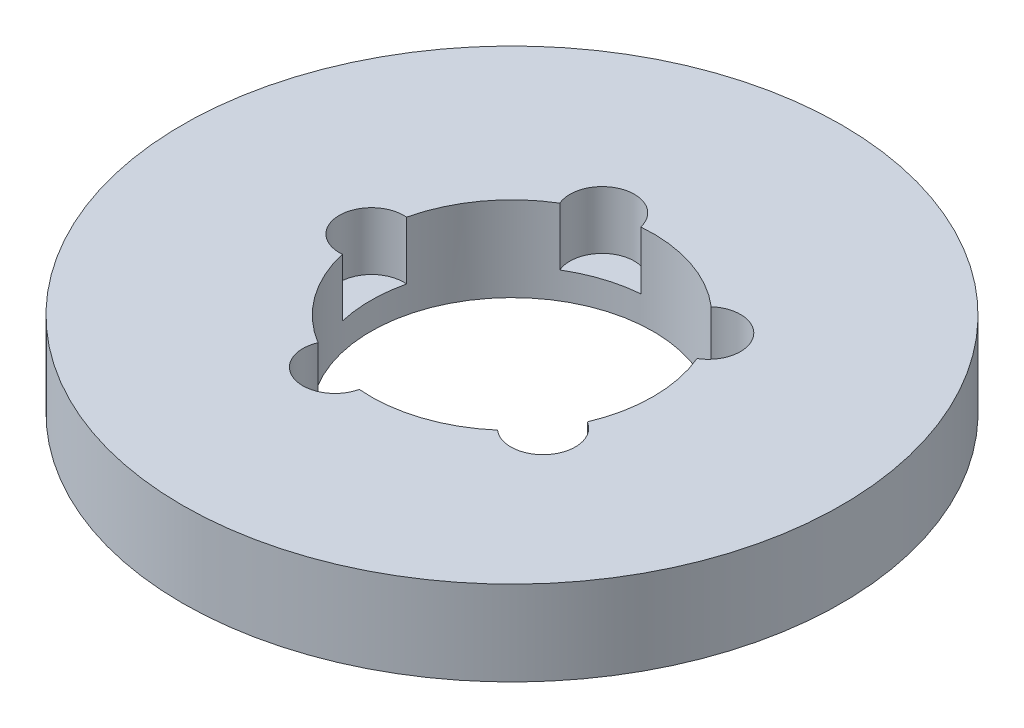
ISO-10303-21;
HEADER;
FILE_DESCRIPTION(('STEP AP214'),'2;1');
FILE_NAME('part.step','',(''),(''),'','','');
FILE_SCHEMA(('AUTOMOTIVE_DESIGN { 1 0 10303 214 1 1 1 1 }'));
ENDSEC;
DATA;
#1=APPLICATION_CONTEXT('core data for automotive mechanical design processes');
#2=APPLICATION_PROTOCOL_DEFINITION('international standard','automotive_design',2000,#1);
#3=PRODUCT_CONTEXT('',#1,'mechanical');
#4=PRODUCT('Part','Part','',(#3));
#5=PRODUCT_RELATED_PRODUCT_CATEGORY('part','',(#4));
#6=PRODUCT_DEFINITION_FORMATION('','',#4);
#7=PRODUCT_DEFINITION_CONTEXT('part definition',#1,'design');
#8=PRODUCT_DEFINITION('design','',#6,#7);
#9=PRODUCT_DEFINITION_SHAPE('','',#8);
#10=(LENGTH_UNIT() NAMED_UNIT(*) SI_UNIT(.MILLI.,.METRE.));
#11=(NAMED_UNIT(*) PLANE_ANGLE_UNIT() SI_UNIT($,.RADIAN.));
#12=(NAMED_UNIT(*) SI_UNIT($,.STERADIAN.) SOLID_ANGLE_UNIT());
#13=UNCERTAINTY_MEASURE_WITH_UNIT(LENGTH_MEASURE(1.E-05),#10,'distance_accuracy_value','');
#14=(GEOMETRIC_REPRESENTATION_CONTEXT(3) GLOBAL_UNCERTAINTY_ASSIGNED_CONTEXT((#13)) GLOBAL_UNIT_ASSIGNED_CONTEXT((#10,
#11,#12)) REPRESENTATION_CONTEXT('',''));
#15=CARTESIAN_POINT('',(0.,0.,0.));
#16=DIRECTION('',(0.,0.,1.));
#17=DIRECTION('',(1.,0.,0.));
#18=AXIS2_PLACEMENT_3D('',#15,#16,#17);
#19=CARTESIAN_POINT('',(0.,18.,0.));
#20=DIRECTION('',(0.,-1.,0.));
#21=DIRECTION('',(0.,0.,-1.));
#22=AXIS2_PLACEMENT_3D('',#19,#20,#21);
#23=CYLINDRICAL_SURFACE('',#22,70.);
#24=CARTESIAN_POINT('',(0.,18.,0.));
#25=DIRECTION('',(0.,1.,0.));
#26=DIRECTION('',(0.,0.,1.));
#27=AXIS2_PLACEMENT_3D('',#24,#25,#26);
#28=CIRCLE('',#27,70.);
#29=CARTESIAN_POINT('',(0.,18.,70.));
#30=VERTEX_POINT('',#29);
#31=EDGE_CURVE('E157',#30,#30,#28,.T.);
#32=ORIENTED_EDGE('',*,*,#31,.F.);
#33=EDGE_LOOP('',(#32));
#34=FACE_BOUND('',#33,.T.);
#35=CARTESIAN_POINT('',(0.,0.,0.));
#36=DIRECTION('',(0.,1.,0.));
#37=DIRECTION('',(0.,0.,1.));
#38=AXIS2_PLACEMENT_3D('',#35,#36,#37);
#39=CIRCLE('',#38,70.);
#40=CARTESIAN_POINT('',(0.,0.,70.));
#41=VERTEX_POINT('',#40);
#42=EDGE_CURVE('E150',#41,#41,#39,.T.);
#43=ORIENTED_EDGE('',*,*,#42,.T.);
#44=EDGE_LOOP('',(#43));
#45=FACE_BOUND('',#44,.T.);
#46=ADVANCED_FACE('F39',(#34,#45),#23,.T.);
#47=CARTESIAN_POINT('',(0.,18.,0.));
#48=DIRECTION('',(0.,1.,0.));
#49=DIRECTION('',(0.,0.,1.));
#50=AXIS2_PLACEMENT_3D('',#47,#48,#49);
#51=PLANE('',#50);
#52=CARTESIAN_POINT('',(-9.21993099503934,18.,-28.3760298373233));
#53=DIRECTION('',(0.,1.,0.));
#54=DIRECTION('',(-0.95105651629515,0.,0.309016994374958));
#55=AXIS2_PLACEMENT_3D('',#52,#53,#54);
#56=CIRCLE('',#55,6.85275653735865);
#57=CARTESIAN_POINT('',(-2.53707938907956,18.,-29.8925279655888));
#58=VERTEX_POINT('',#57);
#59=CARTESIAN_POINT('',(-15.5178467500702,18.,-25.6748209777855));
#60=VERTEX_POINT('',#59);
#61=EDGE_CURVE('E194',#58,#60,#56,.T.);
#62=ORIENTED_EDGE('',*,*,#61,.F.);
#63=CARTESIAN_POINT('',(0.,18.,0.));
#64=DIRECTION('',(0.,1.,0.));
#65=DIRECTION('',(0.,0.,1.));
#66=AXIS2_PLACEMENT_3D('',#63,#64,#65);
#67=CIRCLE('',#66,30.);
#68=CARTESIAN_POINT('',(19.6229274337567,18.,-22.6923052801939));
#69=VERTEX_POINT('',#68);
#70=EDGE_CURVE('E147',#69,#58,#67,.T.);
#71=ORIENTED_EDGE('',*,*,#70,.F.);
#72=CARTESIAN_POINT('',(24.1380927189406,18.,-17.5373509052472));
#73=DIRECTION('',(0.,1.,0.));
#74=DIRECTION('',(-0.58778525229248,0.,-0.809016994374942));
#75=AXIS2_PLACEMENT_3D('',#72,#73,#74);
#76=CIRCLE('',#75,6.85275653735865);
#77=CARTESIAN_POINT('',(27.6454828629044,18.,-11.6502050315375));
#78=VERTEX_POINT('',#77);
#79=EDGE_CURVE('E254',#78,#69,#76,.T.);
#80=ORIENTED_EDGE('',*,*,#79,.F.);
#81=CARTESIAN_POINT('',(27.6454828629045,18.,11.6502050315371));
#82=VERTEX_POINT('',#81);
#83=EDGE_CURVE('E144',#82,#78,#67,.T.);
#84=ORIENTED_EDGE('',*,*,#83,.F.);
#85=CARTESIAN_POINT('',(24.1380927189409,18.,17.5373509052469));
#86=DIRECTION('',(0.,1.,0.));
#87=DIRECTION('',(0.587785252292469,0.,-0.809016994374951));
#88=AXIS2_PLACEMENT_3D('',#85,#86,#87);
#89=CIRCLE('',#88,6.85275653735865);
#90=CARTESIAN_POINT('',(19.6229274337571,18.,22.6923052801936));
#91=VERTEX_POINT('',#90);
#92=EDGE_CURVE('E141',#91,#82,#89,.T.);
#93=ORIENTED_EDGE('',*,*,#92,.F.);
#94=CARTESIAN_POINT('',(-2.53707938907914,18.,29.8925279655888));
#95=VERTEX_POINT('',#94);
#96=EDGE_CURVE('E134',#95,#91,#67,.T.);
#97=ORIENTED_EDGE('',*,*,#96,.F.);
#98=CARTESIAN_POINT('',(-9.21993099503894,18.,28.3760298373235));
#99=DIRECTION('',(0.,1.,0.));
#100=DIRECTION('',(0.951056516295155,0.,0.309016994374945));
#101=AXIS2_PLACEMENT_3D('',#98,#99,#100);
#102=CIRCLE('',#101,6.85275653735865);
#103=CARTESIAN_POINT('',(-15.5178467500699,18.,25.6748209777857));
#104=VERTEX_POINT('',#103);
#105=EDGE_CURVE('E111',#104,#95,#102,.T.);
#106=ORIENTED_EDGE('',*,*,#105,.F.);
#107=CARTESIAN_POINT('',(-29.2134841575122,18.,6.82439326085339));
#108=VERTEX_POINT('',#107);
#109=EDGE_CURVE('E145',#108,#104,#67,.T.);
#110=ORIENTED_EDGE('',*,*,#109,.F.);
#111=CARTESIAN_POINT('',(-29.8363234478035,18.,0.));
#112=DIRECTION('',(0.,1.,0.));
#113=DIRECTION('',(0.,0.,1.));
#114=AXIS2_PLACEMENT_3D('',#111,#112,#113);
#115=CIRCLE('',#114,6.85275653735865);
#116=CARTESIAN_POINT('',(-29.2134841575122,18.,-6.82439326085339));
#117=VERTEX_POINT('',#116);
#118=EDGE_CURVE('E153',#117,#108,#115,.T.);
#119=ORIENTED_EDGE('',*,*,#118,.F.);
#120=EDGE_CURVE('E146',#60,#117,#67,.T.);
#121=ORIENTED_EDGE('',*,*,#120,.F.);
#122=EDGE_LOOP('',(#62,#71,#80,#84,#93,#97,#106,#110,#119,#121));
#123=FACE_BOUND('',#122,.T.);
#124=ORIENTED_EDGE('',*,*,#31,.T.);
#125=EDGE_LOOP('',(#124));
#126=FACE_BOUND('',#125,.T.);
#127=ADVANCED_FACE('F139',(#123,#126),#51,.T.);
#128=CARTESIAN_POINT('',(0.,0.,0.));
#129=DIRECTION('',(0.,1.,0.));
#130=DIRECTION('',(0.,0.,1.));
#131=AXIS2_PLACEMENT_3D('',#128,#129,#130);
#132=PLANE('',#131);
#133=CARTESIAN_POINT('',(0.,0.,0.));
#134=DIRECTION('',(0.,1.,0.));
#135=DIRECTION('',(0.,0.,1.));
#136=AXIS2_PLACEMENT_3D('',#133,#134,#135);
#137=CIRCLE('',#136,30.);
#138=CARTESIAN_POINT('',(0.,0.,30.));
#139=VERTEX_POINT('',#138);
#140=EDGE_CURVE('E154',#139,#139,#137,.T.);
#141=ORIENTED_EDGE('',*,*,#140,.T.);
#142=EDGE_LOOP('',(#141));
#143=FACE_BOUND('',#142,.T.);
#144=ORIENTED_EDGE('',*,*,#42,.F.);
#145=EDGE_LOOP('',(#144));
#146=FACE_BOUND('',#145,.T.);
#147=ADVANCED_FACE('F213',(#143,#146),#132,.F.);
#148=CARTESIAN_POINT('',(0.,18.,0.));
#149=DIRECTION('',(0.,-1.,0.));
#150=DIRECTION('',(0.,0.,-1.));
#151=AXIS2_PLACEMENT_3D('',#148,#149,#150);
#152=CYLINDRICAL_SURFACE('',#151,30.);
#153=DIRECTION('',(0.,1.,0.));
#154=VECTOR('',#153,1.);
#155=CARTESIAN_POINT('',(-2.53707938907956,11.8504540255946,-29.8925279655888));
#156=LINE('',#155,#154);
#157=CARTESIAN_POINT('',(-2.53707938907956,5.70090805118929,-29.8925279655888));
#158=VERTEX_POINT('',#157);
#159=EDGE_CURVE('E11',#158,#58,#156,.T.);
#160=ORIENTED_EDGE('',*,*,#159,.F.);
#161=CARTESIAN_POINT('',(0.,5.70090805118929,0.));
#162=DIRECTION('',(0.,1.,0.));
#163=DIRECTION('',(0.,0.,1.));
#164=AXIS2_PLACEMENT_3D('',#161,#162,#163);
#165=CIRCLE('',#164,30.);
#166=CARTESIAN_POINT('',(-15.5178467500702,5.70090805118929,-25.6748209777855));
#167=VERTEX_POINT('',#166);
#168=EDGE_CURVE('E189',#158,#167,#165,.T.);
#169=ORIENTED_EDGE('',*,*,#168,.T.);
#170=DIRECTION('',(0.,1.,0.));
#171=VECTOR('',#170,1.);
#172=CARTESIAN_POINT('',(-15.5178467500702,11.8504540255946,-25.6748209777855));
#173=LINE('',#172,#171);
#174=EDGE_CURVE('E46',#60,#167,#173,.F.);
#175=ORIENTED_EDGE('',*,*,#174,.F.);
#176=ORIENTED_EDGE('',*,*,#120,.T.);
#177=DIRECTION('',(0.,1.,0.));
#178=VECTOR('',#177,1.);
#179=CARTESIAN_POINT('',(-29.2134841575122,11.8504540255946,-6.82439326085339));
#180=LINE('',#179,#178);
#181=CARTESIAN_POINT('',(-29.2134841575122,5.70090805118929,-6.82439326085339));
#182=VERTEX_POINT('',#181);
#183=EDGE_CURVE('E168',#182,#117,#180,.T.);
#184=ORIENTED_EDGE('',*,*,#183,.F.);
#185=CARTESIAN_POINT('',(0.,5.70090805118929,0.));
#186=DIRECTION('',(0.,1.,0.));
#187=DIRECTION('',(0.,0.,1.));
#188=AXIS2_PLACEMENT_3D('',#185,#186,#187);
#189=CIRCLE('',#188,30.);
#190=CARTESIAN_POINT('',(-29.2134841575122,5.70090805118929,6.82439326085339));
#191=VERTEX_POINT('',#190);
#192=EDGE_CURVE('E165',#182,#191,#189,.T.);
#193=ORIENTED_EDGE('',*,*,#192,.T.);
#194=DIRECTION('',(0.,1.,0.));
#195=VECTOR('',#194,1.);
#196=CARTESIAN_POINT('',(-29.2134841575122,11.8504540255946,6.82439326085339));
#197=LINE('',#196,#195);
#198=EDGE_CURVE('E170',#108,#191,#197,.F.);
#199=ORIENTED_EDGE('',*,*,#198,.F.);
#200=ORIENTED_EDGE('',*,*,#109,.T.);
#201=DIRECTION('',(0.,1.,0.));
#202=VECTOR('',#201,1.);
#203=CARTESIAN_POINT('',(-15.5178467500699,11.8504540255946,25.6748209777857));
#204=LINE('',#203,#202);
#205=CARTESIAN_POINT('',(-15.5178467500699,5.70090805118929,25.6748209777857));
#206=VERTEX_POINT('',#205);
#207=EDGE_CURVE('E121',#206,#104,#204,.T.);
#208=ORIENTED_EDGE('',*,*,#207,.F.);
#209=CARTESIAN_POINT('',(0.,5.70090805118929,0.));
#210=DIRECTION('',(0.,1.,0.));
#211=DIRECTION('',(0.,0.,1.));
#212=AXIS2_PLACEMENT_3D('',#209,#210,#211);
#213=CIRCLE('',#212,30.);
#214=CARTESIAN_POINT('',(-2.53707938907914,5.70090805118929,29.8925279655888));
#215=VERTEX_POINT('',#214);
#216=EDGE_CURVE('E136',#206,#215,#213,.T.);
#217=ORIENTED_EDGE('',*,*,#216,.T.);
#218=DIRECTION('',(0.,1.,0.));
#219=VECTOR('',#218,1.);
#220=CARTESIAN_POINT('',(-2.53707938907914,11.8504540255946,29.8925279655888));
#221=LINE('',#220,#219);
#222=EDGE_CURVE('E117',#95,#215,#221,.F.);
#223=ORIENTED_EDGE('',*,*,#222,.F.);
#224=ORIENTED_EDGE('',*,*,#96,.T.);
#225=DIRECTION('',(0.,1.,0.));
#226=VECTOR('',#225,1.);
#227=CARTESIAN_POINT('',(19.6229274337571,11.8504540255946,22.6923052801936));
#228=LINE('',#227,#226);
#229=CARTESIAN_POINT('',(19.6229274337571,5.70090805118929,22.6923052801936));
#230=VERTEX_POINT('',#229);
#231=EDGE_CURVE('E182',#230,#91,#228,.T.);
#232=ORIENTED_EDGE('',*,*,#231,.F.);
#233=CARTESIAN_POINT('',(0.,5.70090805118929,0.));
#234=DIRECTION('',(0.,1.,0.));
#235=DIRECTION('',(0.,0.,1.));
#236=AXIS2_PLACEMENT_3D('',#233,#234,#235);
#237=CIRCLE('',#236,30.);
#238=CARTESIAN_POINT('',(27.6454828629045,5.70090805118929,11.6502050315371));
#239=VERTEX_POINT('',#238);
#240=EDGE_CURVE('E174',#230,#239,#237,.T.);
#241=ORIENTED_EDGE('',*,*,#240,.T.);
#242=DIRECTION('',(0.,1.,0.));
#243=VECTOR('',#242,1.);
#244=CARTESIAN_POINT('',(27.6454828629045,11.8504540255946,11.6502050315371));
#245=LINE('',#244,#243);
#246=EDGE_CURVE('E177',#82,#239,#245,.F.);
#247=ORIENTED_EDGE('',*,*,#246,.F.);
#248=ORIENTED_EDGE('',*,*,#83,.T.);
#249=DIRECTION('',(0.,1.,0.));
#250=VECTOR('',#249,1.);
#251=CARTESIAN_POINT('',(27.6454828629044,11.8504540255946,-11.6502050315375));
#252=LINE('',#251,#250);
#253=CARTESIAN_POINT('',(27.6454828629044,5.70090805118929,-11.6502050315375));
#254=VERTEX_POINT('',#253);
#255=EDGE_CURVE('E187',#254,#78,#252,.T.);
#256=ORIENTED_EDGE('',*,*,#255,.F.);
#257=CARTESIAN_POINT('',(0.,5.70090805118929,0.));
#258=DIRECTION('',(0.,1.,0.));
#259=DIRECTION('',(0.,0.,1.));
#260=AXIS2_PLACEMENT_3D('',#257,#258,#259);
#261=CIRCLE('',#260,30.);
#262=CARTESIAN_POINT('',(19.6229274337567,5.70090805118929,-22.6923052801939));
#263=VERTEX_POINT('',#262);
#264=EDGE_CURVE('E181',#254,#263,#261,.T.);
#265=ORIENTED_EDGE('',*,*,#264,.T.);
#266=DIRECTION('',(0.,1.,0.));
#267=VECTOR('',#266,1.);
#268=CARTESIAN_POINT('',(19.6229274337567,11.8504540255946,-22.6923052801939));
#269=LINE('',#268,#267);
#270=EDGE_CURVE('E186',#69,#263,#269,.F.);
#271=ORIENTED_EDGE('',*,*,#270,.F.);
#272=ORIENTED_EDGE('',*,*,#70,.T.);
#273=EDGE_LOOP('',(#160,#169,#175,#176,#184,#193,#199,#200,#208,#217,#223,#224,#232,#241,#247,
#248,#256,#265,#271,#272));
#274=FACE_BOUND('',#273,.T.);
#275=ORIENTED_EDGE('',*,*,#140,.F.);
#276=EDGE_LOOP('',(#275));
#277=FACE_BOUND('',#276,.T.);
#278=ADVANCED_FACE('F135',(#274,#277),#152,.F.);
#279=CARTESIAN_POINT('',(-29.8363234478035,5.70090805118929,0.));
#280=DIRECTION('',(0.,1.,0.));
#281=DIRECTION('',(0.,0.,1.));
#282=AXIS2_PLACEMENT_3D('',#279,#280,#281);
#283=CYLINDRICAL_SURFACE('',#282,6.85275653735865);
#284=ORIENTED_EDGE('',*,*,#183,.T.);
#285=ORIENTED_EDGE('',*,*,#118,.T.);
#286=ORIENTED_EDGE('',*,*,#198,.T.);
#287=CARTESIAN_POINT('',(-29.8363234478035,5.70090805118929,0.));
#288=DIRECTION('',(0.,1.,0.));
#289=DIRECTION('',(0.,0.,1.));
#290=AXIS2_PLACEMENT_3D('',#287,#288,#289);
#291=CIRCLE('',#290,6.85275653735865);
#292=EDGE_CURVE('E158',#182,#191,#291,.T.);
#293=ORIENTED_EDGE('',*,*,#292,.F.);
#294=EDGE_LOOP('',(#284,#285,#286,#293));
#295=FACE_BOUND('',#294,.T.);
#296=ADVANCED_FACE('F221',(#295),#283,.F.);
#297=CARTESIAN_POINT('',(-29.8363234478035,5.70090805118929,0.));
#298=DIRECTION('',(0.,1.,0.));
#299=DIRECTION('',(0.,0.,1.));
#300=AXIS2_PLACEMENT_3D('',#297,#298,#299);
#301=PLANE('',#300);
#302=ORIENTED_EDGE('',*,*,#292,.T.);
#303=ORIENTED_EDGE('',*,*,#192,.F.);
#304=EDGE_LOOP('',(#302,#303));
#305=FACE_BOUND('',#304,.T.);
#306=ADVANCED_FACE('F227',(#305),#301,.T.);
#307=CARTESIAN_POINT('',(-9.21993099503894,5.70090805118929,28.3760298373235));
#308=DIRECTION('',(0.,1.,0.));
#309=DIRECTION('',(0.,0.,1.));
#310=AXIS2_PLACEMENT_3D('',#307,#308,#309);
#311=CYLINDRICAL_SURFACE('',#310,6.85275653735865);
#312=ORIENTED_EDGE('',*,*,#207,.T.);
#313=ORIENTED_EDGE('',*,*,#105,.T.);
#314=ORIENTED_EDGE('',*,*,#222,.T.);
#315=CARTESIAN_POINT('',(-9.21993099503894,5.70090805118929,28.3760298373235));
#316=DIRECTION('',(0.,1.,0.));
#317=DIRECTION('',(0.951056516295155,0.,0.309016994374945));
#318=AXIS2_PLACEMENT_3D('',#315,#316,#317);
#319=CIRCLE('',#318,6.85275653735865);
#320=EDGE_CURVE('E127',#206,#215,#319,.T.);
#321=ORIENTED_EDGE('',*,*,#320,.F.);
#322=EDGE_LOOP('',(#312,#313,#314,#321));
#323=FACE_BOUND('',#322,.T.);
#324=ADVANCED_FACE('F116',(#323),#311,.F.);
#325=CARTESIAN_POINT('',(-9.21993099503894,5.70090805118929,28.3760298373235));
#326=DIRECTION('',(0.,1.,0.));
#327=DIRECTION('',(0.951056516295155,0.,0.309016994374945));
#328=AXIS2_PLACEMENT_3D('',#325,#326,#327);
#329=PLANE('',#328);
#330=ORIENTED_EDGE('',*,*,#320,.T.);
#331=ORIENTED_EDGE('',*,*,#216,.F.);
#332=EDGE_LOOP('',(#330,#331));
#333=FACE_BOUND('',#332,.T.);
#334=ADVANCED_FACE('F234',(#333),#329,.T.);
#335=CARTESIAN_POINT('',(24.1380927189409,5.70090805118929,17.5373509052469));
#336=DIRECTION('',(0.,1.,0.));
#337=DIRECTION('',(0.,0.,1.));
#338=AXIS2_PLACEMENT_3D('',#335,#336,#337);
#339=CYLINDRICAL_SURFACE('',#338,6.85275653735865);
#340=ORIENTED_EDGE('',*,*,#231,.T.);
#341=ORIENTED_EDGE('',*,*,#92,.T.);
#342=ORIENTED_EDGE('',*,*,#246,.T.);
#343=CARTESIAN_POINT('',(24.1380927189409,5.70090805118929,17.5373509052469));
#344=DIRECTION('',(0.,1.,0.));
#345=DIRECTION('',(0.587785252292469,0.,-0.809016994374951));
#346=AXIS2_PLACEMENT_3D('',#343,#344,#345);
#347=CIRCLE('',#346,6.85275653735865);
#348=EDGE_CURVE('E130',#230,#239,#347,.T.);
#349=ORIENTED_EDGE('',*,*,#348,.F.);
#350=EDGE_LOOP('',(#340,#341,#342,#349));
#351=FACE_BOUND('',#350,.T.);
#352=ADVANCED_FACE('F240',(#351),#339,.F.);
#353=CARTESIAN_POINT('',(24.1380927189409,5.70090805118929,17.5373509052469));
#354=DIRECTION('',(0.,1.,0.));
#355=DIRECTION('',(0.587785252292469,0.,-0.809016994374951));
#356=AXIS2_PLACEMENT_3D('',#353,#354,#355);
#357=PLANE('',#356);
#358=ORIENTED_EDGE('',*,*,#348,.T.);
#359=ORIENTED_EDGE('',*,*,#240,.F.);
#360=EDGE_LOOP('',(#358,#359));
#361=FACE_BOUND('',#360,.T.);
#362=ADVANCED_FACE('F245',(#361),#357,.T.);
#363=CARTESIAN_POINT('',(24.1380927189406,5.70090805118929,-17.5373509052472));
#364=DIRECTION('',(0.,1.,0.));
#365=DIRECTION('',(0.,0.,1.));
#366=AXIS2_PLACEMENT_3D('',#363,#364,#365);
#367=CYLINDRICAL_SURFACE('',#366,6.85275653735865);
#368=ORIENTED_EDGE('',*,*,#255,.T.);
#369=ORIENTED_EDGE('',*,*,#79,.T.);
#370=ORIENTED_EDGE('',*,*,#270,.T.);
#371=CARTESIAN_POINT('',(24.1380927189406,5.70090805118929,-17.5373509052472));
#372=DIRECTION('',(0.,1.,0.));
#373=DIRECTION('',(-0.58778525229248,0.,-0.809016994374942));
#374=AXIS2_PLACEMENT_3D('',#371,#372,#373);
#375=CIRCLE('',#374,6.85275653735865);
#376=EDGE_CURVE('E56',#254,#263,#375,.T.);
#377=ORIENTED_EDGE('',*,*,#376,.F.);
#378=EDGE_LOOP('',(#368,#369,#370,#377));
#379=FACE_BOUND('',#378,.T.);
#380=ADVANCED_FACE('F266',(#379),#367,.F.);
#381=CARTESIAN_POINT('',(24.1380927189406,5.70090805118929,-17.5373509052472));
#382=DIRECTION('',(0.,1.,0.));
#383=DIRECTION('',(-0.58778525229248,0.,-0.809016994374942));
#384=AXIS2_PLACEMENT_3D('',#381,#382,#383);
#385=PLANE('',#384);
#386=ORIENTED_EDGE('',*,*,#376,.T.);
#387=ORIENTED_EDGE('',*,*,#264,.F.);
#388=EDGE_LOOP('',(#386,#387));
#389=FACE_BOUND('',#388,.T.);
#390=ADVANCED_FACE('F204',(#389),#385,.T.);
#391=CARTESIAN_POINT('',(-9.21993099503934,5.70090805118929,-28.3760298373233));
#392=DIRECTION('',(0.,1.,0.));
#393=DIRECTION('',(0.,0.,1.));
#394=AXIS2_PLACEMENT_3D('',#391,#392,#393);
#395=CYLINDRICAL_SURFACE('',#394,6.85275653735865);
#396=ORIENTED_EDGE('',*,*,#159,.T.);
#397=ORIENTED_EDGE('',*,*,#61,.T.);
#398=ORIENTED_EDGE('',*,*,#174,.T.);
#399=CARTESIAN_POINT('',(-9.21993099503934,5.70090805118929,-28.3760298373233));
#400=DIRECTION('',(0.,1.,0.));
#401=DIRECTION('',(-0.95105651629515,0.,0.309016994374958));
#402=AXIS2_PLACEMENT_3D('',#399,#400,#401);
#403=CIRCLE('',#402,6.85275653735865);
#404=EDGE_CURVE('E55',#158,#167,#403,.T.);
#405=ORIENTED_EDGE('',*,*,#404,.F.);
#406=EDGE_LOOP('',(#396,#397,#398,#405));
#407=FACE_BOUND('',#406,.T.);
#408=ADVANCED_FACE('F193',(#407),#395,.F.);
#409=CARTESIAN_POINT('',(-9.21993099503934,5.70090805118929,-28.3760298373233));
#410=DIRECTION('',(0.,1.,0.));
#411=DIRECTION('',(-0.95105651629515,0.,0.309016994374958));
#412=AXIS2_PLACEMENT_3D('',#409,#410,#411);
#413=PLANE('',#412);
#414=ORIENTED_EDGE('',*,*,#404,.T.);
#415=ORIENTED_EDGE('',*,*,#168,.F.);
#416=EDGE_LOOP('',(#414,#415));
#417=FACE_BOUND('',#416,.T.);
#418=ADVANCED_FACE('F196',(#417),#413,.T.);
#419=CLOSED_SHELL('',(#46,#127,#147,#278,#296,#306,#324,#334,#352,#362,#380,#390,#408,#418));
#420=MANIFOLD_SOLID_BREP('B2',#419);
#421=ADVANCED_BREP_SHAPE_REPRESENTATION('',(#18,#420),#14);
#422=SHAPE_DEFINITION_REPRESENTATION(#9,#421);
ENDSEC;
END-ISO-10303-21;
